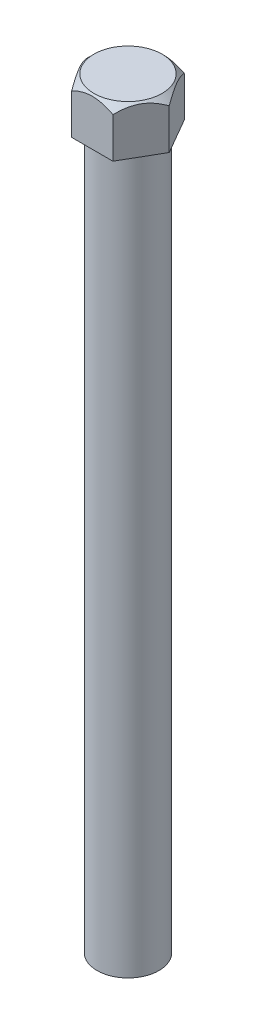
ISO-10303-21;
HEADER;
FILE_DESCRIPTION(('STEP AP214'),'2;1');
FILE_NAME('part.step','',(''),(''),'','','');
FILE_SCHEMA(('AUTOMOTIVE_DESIGN { 1 0 10303 214 1 1 1 1 }'));
ENDSEC;
DATA;
#1=APPLICATION_CONTEXT('core data for automotive mechanical design processes');
#2=APPLICATION_PROTOCOL_DEFINITION('international standard','automotive_design',2000,#1);
#3=PRODUCT_CONTEXT('',#1,'mechanical');
#4=PRODUCT('Part','Part','',(#3));
#5=PRODUCT_RELATED_PRODUCT_CATEGORY('part','',(#4));
#6=PRODUCT_DEFINITION_FORMATION('','',#4);
#7=PRODUCT_DEFINITION_CONTEXT('part definition',#1,'design');
#8=PRODUCT_DEFINITION('design','',#6,#7);
#9=PRODUCT_DEFINITION_SHAPE('','',#8);
#10=(LENGTH_UNIT() NAMED_UNIT(*) SI_UNIT(.MILLI.,.METRE.));
#11=(NAMED_UNIT(*) PLANE_ANGLE_UNIT() SI_UNIT($,.RADIAN.));
#12=(NAMED_UNIT(*) SI_UNIT($,.STERADIAN.) SOLID_ANGLE_UNIT());
#13=UNCERTAINTY_MEASURE_WITH_UNIT(LENGTH_MEASURE(1.E-05),#10,'distance_accuracy_value','');
#14=(GEOMETRIC_REPRESENTATION_CONTEXT(3) GLOBAL_UNCERTAINTY_ASSIGNED_CONTEXT((#13)) GLOBAL_UNIT_ASSIGNED_CONTEXT((#10,
#11,#12)) REPRESENTATION_CONTEXT('',''));
#15=CARTESIAN_POINT('',(0.,0.,0.));
#16=DIRECTION('',(0.,0.,1.));
#17=DIRECTION('',(1.,0.,0.));
#18=AXIS2_PLACEMENT_3D('',#15,#16,#17);
#19=CARTESIAN_POINT('',(0.,3.2,0.));
#20=DIRECTION('',(0.,-1.,0.));
#21=DIRECTION('',(0.,0.,-1.));
#22=AXIS2_PLACEMENT_3D('',#19,#20,#21);
#23=CYLINDRICAL_SURFACE('',#22,0.13);
#24=CARTESIAN_POINT('',(0.,0.,0.));
#25=DIRECTION('',(0.,1.,0.));
#26=DIRECTION('',(0.,0.,1.));
#27=AXIS2_PLACEMENT_3D('',#24,#25,#26);
#28=CIRCLE('',#27,0.13);
#29=CARTESIAN_POINT('',(0.,0.,0.13));
#30=VERTEX_POINT('',#29);
#31=EDGE_CURVE('E45',#30,#30,#28,.T.);
#32=ORIENTED_EDGE('',*,*,#31,.T.);
#33=EDGE_LOOP('',(#32));
#34=FACE_BOUND('',#33,.T.);
#35=CARTESIAN_POINT('',(0.,3.,0.));
#36=DIRECTION('',(0.,1.,0.));
#37=DIRECTION('',(0.,0.,1.));
#38=AXIS2_PLACEMENT_3D('',#35,#36,#37);
#39=CIRCLE('',#38,0.13);
#40=CARTESIAN_POINT('',(0.,3.,0.13));
#41=VERTEX_POINT('',#40);
#42=EDGE_CURVE('E12',#41,#41,#39,.T.);
#43=ORIENTED_EDGE('',*,*,#42,.F.);
#44=EDGE_LOOP('',(#43));
#45=FACE_BOUND('',#44,.T.);
#46=ADVANCED_FACE('F38',(#34,#45),#23,.T.);
#47=CARTESIAN_POINT('',(0.,0.,0.));
#48=DIRECTION('',(0.,1.,0.));
#49=DIRECTION('',(0.,0.,1.));
#50=AXIS2_PLACEMENT_3D('',#47,#48,#49);
#51=PLANE('',#50);
#52=ORIENTED_EDGE('',*,*,#31,.F.);
#53=EDGE_LOOP('',(#52));
#54=FACE_BOUND('',#53,.T.);
#55=ADVANCED_FACE('F217',(#54),#51,.F.);
#56=CARTESIAN_POINT('',(0.0866025403784439,3.,0.15));
#57=DIRECTION('',(0.866025403784439,0.,0.5));
#58=DIRECTION('',(0.5,0.,-0.866025403784439));
#59=AXIS2_PLACEMENT_3D('',#56,#57,#58);
#60=PLANE('',#59);
#61=CARTESIAN_POINT('',(0.086487070324606,3.16988441455308,0.1502));
#62=CARTESIAN_POINT('',(0.0894747314856735,3.1728692939954,0.145025219073231));
#63=CARTESIAN_POINT('',(0.0925061847269978,3.17568184718681,0.139774588038488));
#64=CARTESIAN_POINT('',(0.0986880826967588,3.18083264194967,0.129067226667655));
#65=CARTESIAN_POINT('',(0.101839121414635,3.18316800261969,0.123609467511676));
#66=CARTESIAN_POINT('',(0.11134442329311,3.18913429872302,0.107145801716878));
#67=CARTESIAN_POINT('',(0.11786349315152,3.19184967701747,0.0958544415040206));
#68=CARTESIAN_POINT('',(0.129142807751294,3.19349253805002,0.076318095542659));
#69=CARTESIAN_POINT('',(0.133872001410017,3.19328220421558,0.0681268918469176));
#70=CARTESIAN_POINT('',(0.143233752389886,3.19113971144166,0.0519118635019782));
#71=CARTESIAN_POINT('',(0.147866153897475,3.18920496684668,0.043888308729774));
#72=CARTESIAN_POINT('',(0.156018491692504,3.18452576928618,0.0297680454683198));
#73=CARTESIAN_POINT('',(0.159575311102254,3.18202131757065,0.023607453537286));
#74=CARTESIAN_POINT('',(0.166548991597766,3.17637725141577,0.0115286846033072));
#75=CARTESIAN_POINT('',(0.169966264641955,3.17323969799707,0.00560979406743729));
#76=CARTESIAN_POINT('',(0.173320550810916,3.1698844145544,-0.00020000000032879));
#77=B_SPLINE_CURVE_WITH_KNOTS('',3,(#61,#62,#63,#64,#65,#66,#67,#68,#69,#70,#71,#72,#73,#74,#75,
#76),.UNSPECIFIED.,.F.,.F.,(4,2,2,2,2,2,2,4),(0.,0.0200322815723704,0.0401821439649001,
0.0797202979159774,0.107933680780694,0.136189439305523,0.158782101417156,0.181302367981686),.UNSPECIFIED.);
#78=CARTESIAN_POINT('',(0.0866025403784439,3.17,0.15));
#79=VERTEX_POINT('',#78);
#80=CARTESIAN_POINT('',(0.173205080756888,3.17,0.));
#81=VERTEX_POINT('',#80);
#82=EDGE_CURVE('E52',#79,#81,#77,.T.);
#83=ORIENTED_EDGE('',*,*,#82,.F.);
#84=DIRECTION('',(0.,1.,0.));
#85=VECTOR('',#84,1.);
#86=CARTESIAN_POINT('',(0.0866025403784439,3.,0.15));
#87=LINE('',#86,#85);
#88=CARTESIAN_POINT('',(0.0866025403784439,3.,0.15));
#89=VERTEX_POINT('',#88);
#90=EDGE_CURVE('E59',#89,#79,#87,.T.);
#91=ORIENTED_EDGE('',*,*,#90,.F.);
#92=DIRECTION('',(0.5,0.,-0.866025403784439));
#93=VECTOR('',#92,1.);
#94=CARTESIAN_POINT('',(0.0866025403784439,3.,0.15));
#95=LINE('',#94,#93);
#96=CARTESIAN_POINT('',(0.173205080756888,3.,0.));
#97=VERTEX_POINT('',#96);
#98=EDGE_CURVE('E152',#89,#97,#95,.T.);
#99=ORIENTED_EDGE('',*,*,#98,.T.);
#100=DIRECTION('',(0.,1.,0.));
#101=VECTOR('',#100,1.);
#102=CARTESIAN_POINT('',(0.173205080756888,3.,0.));
#103=LINE('',#102,#101);
#104=EDGE_CURVE('E112',#97,#81,#103,.T.);
#105=ORIENTED_EDGE('',*,*,#104,.T.);
#106=EDGE_LOOP('',(#83,#91,#99,#105));
#107=FACE_BOUND('',#106,.T.);
#108=ADVANCED_FACE('F168',(#107),#60,.T.);
#109=CARTESIAN_POINT('',(-0.0866025403784438,3.,0.15));
#110=DIRECTION('',(0.,0.,1.));
#111=DIRECTION('',(1.,0.,0.));
#112=AXIS2_PLACEMENT_3D('',#109,#110,#111);
#113=PLANE('',#112);
#114=CARTESIAN_POINT('',(-0.262586498690913,3.04079531025542,0.15));
#115=CARTESIAN_POINT('',(-0.254826375964097,3.04753180898604,0.15));
#116=CARTESIAN_POINT('',(-0.247031178307719,3.05422893510501,0.15));
#117=CARTESIAN_POINT('',(-0.231345588074377,3.0675182027981,0.15));
#118=CARTESIAN_POINT('',(-0.223455152298885,3.07411029332349,0.15));
#119=CARTESIAN_POINT('',(-0.199257368061424,3.09397318925053,0.15));
#120=CARTESIAN_POINT('',(-0.18277032448999,3.10702502912681,0.15));
#121=CARTESIAN_POINT('',(-0.148967316027862,3.13211580579962,0.15));
#122=CARTESIAN_POINT('',(-0.131650237829541,3.14415331887066,0.15));
#123=CARTESIAN_POINT('',(-0.104665718305433,3.16043305934934,0.15));
#124=CARTESIAN_POINT('',(-0.095536058861514,3.16554887313006,0.15));
#125=CARTESIAN_POINT('',(-0.0768307253928085,3.17486951186746,0.15));
#126=CARTESIAN_POINT('',(-0.0672559060106042,3.17907600142658,0.15));
#127=CARTESIAN_POINT('',(-0.047365239141126,3.18618311770184,0.15));
#128=CARTESIAN_POINT('',(-0.0370376939426327,3.18905284242856,0.15));
#129=CARTESIAN_POINT('',(-0.0160622657114842,3.1926942585075,0.15));
#130=CARTESIAN_POINT('',(-0.00541707791100121,3.19348025944055,0.15));
#131=CARTESIAN_POINT('',(0.0158055590720296,3.19275009157281,0.15));
#132=CARTESIAN_POINT('',(0.0263828573137492,3.19122989601714,0.15));
#133=CARTESIAN_POINT('',(0.0471394448417878,3.18630245273503,0.15));
#134=CARTESIAN_POINT('',(0.057314980952664,3.18288056134072,0.15));
#135=CARTESIAN_POINT('',(0.0792923162711149,3.17389745377027,0.15));
#136=CARTESIAN_POINT('',(0.0909641323370495,3.1680322739945,0.15));
#137=CARTESIAN_POINT('',(0.113704536639996,3.15521226614443,0.15));
#138=CARTESIAN_POINT('',(0.124771511003989,3.14825469801133,0.15));
#139=CARTESIAN_POINT('',(0.157430248891428,3.12637100732597,0.15));
#140=CARTESIAN_POINT('',(0.178371211639007,3.11048964568697,0.15));
#141=CARTESIAN_POINT('',(0.209758792369402,3.08540645403929,0.15));
#142=CARTESIAN_POINT('',(0.220516380024444,3.0765694094161,0.15));
#143=CARTESIAN_POINT('',(0.241730110308999,3.05877647966747,0.15));
#144=CARTESIAN_POINT('',(0.25218827531801,3.04982301149958,0.15));
#145=CARTESIAN_POINT('',(0.262586498690927,3.04079531025543,0.15));
#146=B_SPLINE_CURVE_WITH_KNOTS('',3,(#114,#115,#116,#117,#118,#119,#120,#121,#122,#123,#124,
#125,#126,#127,#128,#129,#130,#131,#132,#133,#134,#135,#136,#137,#138,#139,#140,#141,#142,#143,
#144,#145),.UNSPECIFIED.,.F.,.F.,(4,2,2,2,2,2,2,2,2,2,2,2,2,2,2,4),(0.,0.0308295106196295,
0.0616735738810822,0.124747488513428,0.187908509085987,0.219272585467536,0.250578751447973,
0.282576530373672,0.314353994406208,0.346187007659216,0.378268611399949,0.417354566871306,
0.456540176553572,0.535274804547155,0.577042635629357,0.61834564938272),.UNSPECIFIED.);
#147=CARTESIAN_POINT('',(-0.0866025403784437,3.17,0.15));
#148=VERTEX_POINT('',#147);
#149=EDGE_CURVE('E161',#148,#79,#146,.T.);
#150=ORIENTED_EDGE('',*,*,#149,.F.);
#151=DIRECTION('',(0.,1.,0.));
#152=VECTOR('',#151,1.);
#153=CARTESIAN_POINT('',(-0.0866025403784438,3.,0.15));
#154=LINE('',#153,#152);
#155=CARTESIAN_POINT('',(-0.0866025403784438,3.,0.15));
#156=VERTEX_POINT('',#155);
#157=EDGE_CURVE('E122',#156,#148,#154,.T.);
#158=ORIENTED_EDGE('',*,*,#157,.F.);
#159=DIRECTION('',(1.,0.,0.));
#160=VECTOR('',#159,1.);
#161=CARTESIAN_POINT('',(-0.0866025403784438,3.,0.15));
#162=LINE('',#161,#160);
#163=EDGE_CURVE('E116',#156,#89,#162,.T.);
#164=ORIENTED_EDGE('',*,*,#163,.T.);
#165=ORIENTED_EDGE('',*,*,#90,.T.);
#166=EDGE_LOOP('',(#150,#158,#164,#165));
#167=FACE_BOUND('',#166,.T.);
#168=ADVANCED_FACE('F204',(#167),#113,.T.);
#169=CARTESIAN_POINT('',(-0.173205080756888,3.,0.));
#170=DIRECTION('',(-0.866025403784438,0.,0.5));
#171=DIRECTION('',(0.5,0.,0.866025403784439));
#172=AXIS2_PLACEMENT_3D('',#169,#170,#171);
#173=PLANE('',#172);
#174=CARTESIAN_POINT('',(-0.173320550810726,3.16988441455308,-0.000200000000000038));
#175=CARTESIAN_POINT('',(-0.170332889649658,3.1728692939954,0.0049747809267692));
#176=CARTESIAN_POINT('',(-0.167301436408334,3.17568184718681,0.0102254119615123));
#177=CARTESIAN_POINT('',(-0.161119538438573,3.18083264194967,0.0209327733323452));
#178=CARTESIAN_POINT('',(-0.157968499720696,3.18316800261969,0.0263905324883241));
#179=CARTESIAN_POINT('',(-0.148463197842221,3.18913429872302,0.0428541982831226));
#180=CARTESIAN_POINT('',(-0.141944127983811,3.19184967701747,0.0541455584959796));
#181=CARTESIAN_POINT('',(-0.130664813384037,3.19349253805002,0.0736819044573411));
#182=CARTESIAN_POINT('',(-0.125935619725314,3.19328220421558,0.0818731081530826));
#183=CARTESIAN_POINT('',(-0.116573868745446,3.19113971144166,0.0980881364980219));
#184=CARTESIAN_POINT('',(-0.111941467237856,3.18920496684668,0.106111691270226));
#185=CARTESIAN_POINT('',(-0.103789129442827,3.18452576928618,0.12023195453168));
#186=CARTESIAN_POINT('',(-0.100232310033077,3.18202131757065,0.126392546462714));
#187=CARTESIAN_POINT('',(-0.0932586295375655,3.17637725141577,0.138471315396693));
#188=CARTESIAN_POINT('',(-0.0898413564933771,3.17323969799707,0.144390205932563));
#189=CARTESIAN_POINT('',(-0.086487070324416,3.1698844145544,0.150200000000329));
#190=B_SPLINE_CURVE_WITH_KNOTS('',3,(#174,#175,#176,#177,#178,#179,#180,#181,#182,#183,#184,
#185,#186,#187,#188,#189),.UNSPECIFIED.,.F.,.F.,(4,2,2,2,2,2,2,4),(0.,0.0200322815723705,
0.0401821439649006,0.0797202979159777,0.107933680780694,0.136189439305524,0.158782101417157,
0.181302367981686),.UNSPECIFIED.);
#191=CARTESIAN_POINT('',(-0.173205080756888,3.17,0.));
#192=VERTEX_POINT('',#191);
#193=EDGE_CURVE('E144',#192,#148,#190,.T.);
#194=ORIENTED_EDGE('',*,*,#193,.F.);
#195=DIRECTION('',(0.,1.,0.));
#196=VECTOR('',#195,1.);
#197=CARTESIAN_POINT('',(-0.173205080756888,3.,0.));
#198=LINE('',#197,#196);
#199=CARTESIAN_POINT('',(-0.173205080756888,3.,0.));
#200=VERTEX_POINT('',#199);
#201=EDGE_CURVE('E114',#200,#192,#198,.T.);
#202=ORIENTED_EDGE('',*,*,#201,.F.);
#203=DIRECTION('',(0.5,0.,0.866025403784438));
#204=VECTOR('',#203,1.);
#205=CARTESIAN_POINT('',(-0.173205080756888,3.,0.));
#206=LINE('',#205,#204);
#207=EDGE_CURVE('E142',#200,#156,#206,.T.);
#208=ORIENTED_EDGE('',*,*,#207,.T.);
#209=ORIENTED_EDGE('',*,*,#157,.T.);
#210=EDGE_LOOP('',(#194,#202,#208,#209));
#211=FACE_BOUND('',#210,.T.);
#212=ADVANCED_FACE('F141',(#211),#173,.T.);
#213=CARTESIAN_POINT('',(-0.0866025403784439,3.,-0.15));
#214=DIRECTION('',(-0.866025403784439,0.,-0.5));
#215=DIRECTION('',(-0.5,0.,0.866025403784439));
#216=AXIS2_PLACEMENT_3D('',#213,#214,#215);
#217=PLANE('',#216);
#218=CARTESIAN_POINT('',(-0.0864870703246059,3.16988441455308,-0.1502));
#219=CARTESIAN_POINT('',(-0.0894747314856735,3.1728692939954,-0.145025219073231));
#220=CARTESIAN_POINT('',(-0.0925061847269978,3.17568184718681,-0.139774588038488));
#221=CARTESIAN_POINT('',(-0.0986880826967587,3.18083264194967,-0.129067226667655));
#222=CARTESIAN_POINT('',(-0.101839121414635,3.18316800261969,-0.123609467511676));
#223=CARTESIAN_POINT('',(-0.11134442329311,3.18913429872302,-0.107145801716878));
#224=CARTESIAN_POINT('',(-0.11786349315152,3.19184967701747,-0.0958544415040205));
#225=CARTESIAN_POINT('',(-0.129142807751294,3.19349253805002,-0.0763180955426589));
#226=CARTESIAN_POINT('',(-0.133872001410017,3.19328220421558,-0.0681268918469174));
#227=CARTESIAN_POINT('',(-0.143233752389886,3.19113971144166,-0.051911863501978));
#228=CARTESIAN_POINT('',(-0.147866153897475,3.18920496684668,-0.0438883087297738));
#229=CARTESIAN_POINT('',(-0.156018491692504,3.18452576928618,-0.0297680454683197));
#230=CARTESIAN_POINT('',(-0.159575311102254,3.18202131757065,-0.0236074535372859));
#231=CARTESIAN_POINT('',(-0.166548991597766,3.17637725141577,-0.0115286846033072));
#232=CARTESIAN_POINT('',(-0.169966264641954,3.17323969799707,-0.00560979406743723));
#233=CARTESIAN_POINT('',(-0.173320550810916,3.1698844145544,0.000200000000328849));
#234=B_SPLINE_CURVE_WITH_KNOTS('',3,(#218,#219,#220,#221,#222,#223,#224,#225,#226,#227,#228,
#229,#230,#231,#232,#233),.UNSPECIFIED.,.F.,.F.,(4,2,2,2,2,2,2,4),(0.,0.0200322815723705,
0.0401821439649002,0.0797202979159776,0.107933680780694,0.136189439305524,0.158782101417156,
0.181302367981686),.UNSPECIFIED.);
#235=CARTESIAN_POINT('',(-0.0866025403784439,3.17,-0.15));
#236=VERTEX_POINT('',#235);
#237=EDGE_CURVE('E106',#236,#192,#234,.T.);
#238=ORIENTED_EDGE('',*,*,#237,.F.);
#239=DIRECTION('',(0.,1.,0.));
#240=VECTOR('',#239,1.);
#241=CARTESIAN_POINT('',(-0.0866025403784439,3.,-0.15));
#242=LINE('',#241,#240);
#243=CARTESIAN_POINT('',(-0.0866025403784439,3.,-0.15));
#244=VERTEX_POINT('',#243);
#245=EDGE_CURVE('E105',#244,#236,#242,.T.);
#246=ORIENTED_EDGE('',*,*,#245,.F.);
#247=DIRECTION('',(-0.5,0.,0.866025403784439));
#248=VECTOR('',#247,1.);
#249=CARTESIAN_POINT('',(-0.0866025403784439,3.,-0.15));
#250=LINE('',#249,#248);
#251=EDGE_CURVE('E136',#244,#200,#250,.T.);
#252=ORIENTED_EDGE('',*,*,#251,.T.);
#253=ORIENTED_EDGE('',*,*,#201,.T.);
#254=EDGE_LOOP('',(#238,#246,#252,#253));
#255=FACE_BOUND('',#254,.T.);
#256=ADVANCED_FACE('F134',(#255),#217,.T.);
#257=CARTESIAN_POINT('',(0.0866025403784437,3.,-0.15));
#258=DIRECTION('',(0.,0.,-1.));
#259=DIRECTION('',(-1.,0.,0.));
#260=AXIS2_PLACEMENT_3D('',#257,#258,#259);
#261=PLANE('',#260);
#262=CARTESIAN_POINT('',(0.262586498690913,3.04079531025542,-0.15));
#263=CARTESIAN_POINT('',(0.254826375964097,3.04753180898604,-0.15));
#264=CARTESIAN_POINT('',(0.247031178307719,3.05422893510501,-0.15));
#265=CARTESIAN_POINT('',(0.231345588074376,3.0675182027981,-0.15));
#266=CARTESIAN_POINT('',(0.223455152298884,3.07411029332349,-0.15));
#267=CARTESIAN_POINT('',(0.199257368061424,3.09397318925053,-0.15));
#268=CARTESIAN_POINT('',(0.18277032448999,3.10702502912681,-0.15));
#269=CARTESIAN_POINT('',(0.148967316027862,3.13211580579962,-0.15));
#270=CARTESIAN_POINT('',(0.131650237829541,3.14415331887066,-0.15));
#271=CARTESIAN_POINT('',(0.104665718305433,3.16043305934934,-0.15));
#272=CARTESIAN_POINT('',(0.0955360588615138,3.16554887313006,-0.15));
#273=CARTESIAN_POINT('',(0.0768307253928083,3.17486951186746,-0.15));
#274=CARTESIAN_POINT('',(0.067255906010604,3.17907600142658,-0.15));
#275=CARTESIAN_POINT('',(0.0473652391411258,3.18618311770184,-0.15));
#276=CARTESIAN_POINT('',(0.0370376939426325,3.18905284242856,-0.15));
#277=CARTESIAN_POINT('',(0.016062265711484,3.1926942585075,-0.15));
#278=CARTESIAN_POINT('',(0.005417077911001,3.19348025944055,-0.15));
#279=CARTESIAN_POINT('',(-0.0158055590720298,3.19275009157281,-0.15));
#280=CARTESIAN_POINT('',(-0.0263828573137494,3.19122989601714,-0.15));
#281=CARTESIAN_POINT('',(-0.047139444841788,3.18630245273503,-0.15));
#282=CARTESIAN_POINT('',(-0.0573149809526641,3.18288056134072,-0.15));
#283=CARTESIAN_POINT('',(-0.0792923162711152,3.17389745377027,-0.15));
#284=CARTESIAN_POINT('',(-0.0909641323370499,3.1680322739945,-0.15));
#285=CARTESIAN_POINT('',(-0.113704536639997,3.15521226614443,-0.15));
#286=CARTESIAN_POINT('',(-0.124771511003989,3.14825469801133,-0.15));
#287=CARTESIAN_POINT('',(-0.157430248891428,3.12637100732597,-0.15));
#288=CARTESIAN_POINT('',(-0.178371211639008,3.11048964568697,-0.15));
#289=CARTESIAN_POINT('',(-0.209758792369403,3.08540645403929,-0.15));
#290=CARTESIAN_POINT('',(-0.220516380024444,3.0765694094161,-0.15));
#291=CARTESIAN_POINT('',(-0.241730110308999,3.05877647966747,-0.15));
#292=CARTESIAN_POINT('',(-0.25218827531801,3.04982301149958,-0.15));
#293=CARTESIAN_POINT('',(-0.262586498690927,3.04079531025543,-0.15));
#294=B_SPLINE_CURVE_WITH_KNOTS('',3,(#262,#263,#264,#265,#266,#267,#268,#269,#270,#271,#272,
#273,#274,#275,#276,#277,#278,#279,#280,#281,#282,#283,#284,#285,#286,#287,#288,#289,#290,#291,
#292,#293),.UNSPECIFIED.,.F.,.F.,(4,2,2,2,2,2,2,2,2,2,2,2,2,2,2,4),(0.,0.0308295106196296,
0.0616735738810822,0.124747488513428,0.187908509085987,0.219272585467536,0.250578751447973,
0.282576530373672,0.314353994406208,0.346187007659216,0.378268611399948,0.417354566871306,
0.456540176553572,0.535274804547156,0.577042635629357,0.61834564938272),.UNSPECIFIED.);
#295=CARTESIAN_POINT('',(0.0866025403784437,3.17,-0.15));
#296=VERTEX_POINT('',#295);
#297=EDGE_CURVE('E92',#296,#236,#294,.T.);
#298=ORIENTED_EDGE('',*,*,#297,.F.);
#299=DIRECTION('',(0.,1.,0.));
#300=VECTOR('',#299,1.);
#301=CARTESIAN_POINT('',(0.0866025403784437,3.,-0.15));
#302=LINE('',#301,#300);
#303=CARTESIAN_POINT('',(0.0866025403784437,3.,-0.15));
#304=VERTEX_POINT('',#303);
#305=EDGE_CURVE('E103',#304,#296,#302,.T.);
#306=ORIENTED_EDGE('',*,*,#305,.F.);
#307=DIRECTION('',(-1.,0.,0.));
#308=VECTOR('',#307,1.);
#309=CARTESIAN_POINT('',(0.0866025403784437,3.,-0.15));
#310=LINE('',#309,#308);
#311=EDGE_CURVE('E147',#304,#244,#310,.T.);
#312=ORIENTED_EDGE('',*,*,#311,.T.);
#313=ORIENTED_EDGE('',*,*,#245,.T.);
#314=EDGE_LOOP('',(#298,#306,#312,#313));
#315=FACE_BOUND('',#314,.T.);
#316=ADVANCED_FACE('F101',(#315),#261,.T.);
#317=CARTESIAN_POINT('',(0.173205080756888,3.,0.));
#318=DIRECTION('',(0.866025403784438,0.,-0.5));
#319=DIRECTION('',(-0.5,0.,-0.866025403784439));
#320=AXIS2_PLACEMENT_3D('',#317,#318,#319);
#321=PLANE('',#320);
#322=CARTESIAN_POINT('',(0.173320550810726,3.16988441455308,0.00020000000000009));
#323=CARTESIAN_POINT('',(0.170332889649658,3.1728692939954,-0.00497478092676922));
#324=CARTESIAN_POINT('',(0.167301436408334,3.17568184718681,-0.0102254119615123));
#325=CARTESIAN_POINT('',(0.161119538438573,3.18083264194967,-0.0209327733323453));
#326=CARTESIAN_POINT('',(0.157968499720696,3.18316800261969,-0.0263905324883241));
#327=CARTESIAN_POINT('',(0.148463197842221,3.18913429872302,-0.0428541982831225));
#328=CARTESIAN_POINT('',(0.141944127983811,3.19184967701747,-0.0541455584959796));
#329=CARTESIAN_POINT('',(0.130664813384037,3.19349253805002,-0.0736819044573411));
#330=CARTESIAN_POINT('',(0.125935619725314,3.19328220421558,-0.0818731081530826));
#331=CARTESIAN_POINT('',(0.116573868745446,3.19113971144166,-0.0980881364980219));
#332=CARTESIAN_POINT('',(0.111941467237856,3.18920496684668,-0.106111691270226));
#333=CARTESIAN_POINT('',(0.103789129442827,3.18452576928618,-0.12023195453168));
#334=CARTESIAN_POINT('',(0.100232310033077,3.18202131757065,-0.126392546462714));
#335=CARTESIAN_POINT('',(0.0932586295375655,3.17637725141577,-0.138471315396693));
#336=CARTESIAN_POINT('',(0.089841356493377,3.17323969799707,-0.144390205932563));
#337=CARTESIAN_POINT('',(0.086487070324416,3.1698844145544,-0.150200000000329));
#338=B_SPLINE_CURVE_WITH_KNOTS('',3,(#322,#323,#324,#325,#326,#327,#328,#329,#330,#331,#332,
#333,#334,#335,#336,#337),.UNSPECIFIED.,.F.,.F.,(4,2,2,2,2,2,2,4),(0.,0.0200322815723707,
0.0401821439649006,0.0797202979159778,0.107933680780694,0.136189439305524,0.158782101417157,
0.181302367981686),.UNSPECIFIED.);
#339=EDGE_CURVE('E88',#81,#296,#338,.T.);
#340=ORIENTED_EDGE('',*,*,#339,.F.);
#341=ORIENTED_EDGE('',*,*,#104,.F.);
#342=DIRECTION('',(-0.5,0.,-0.866025403784438));
#343=VECTOR('',#342,1.);
#344=CARTESIAN_POINT('',(0.173205080756888,3.,0.));
#345=LINE('',#344,#343);
#346=EDGE_CURVE('E111',#97,#304,#345,.T.);
#347=ORIENTED_EDGE('',*,*,#346,.T.);
#348=ORIENTED_EDGE('',*,*,#305,.T.);
#349=EDGE_LOOP('',(#340,#341,#347,#348));
#350=FACE_BOUND('',#349,.T.);
#351=ADVANCED_FACE('F109',(#350),#321,.T.);
#352=CARTESIAN_POINT('',(0.,3.,0.));
#353=DIRECTION('',(0.,1.,0.));
#354=DIRECTION('',(0.,0.,1.));
#355=AXIS2_PLACEMENT_3D('',#352,#353,#354);
#356=PLANE('',#355);
#357=ORIENTED_EDGE('',*,*,#42,.T.);
#358=EDGE_LOOP('',(#357));
#359=FACE_BOUND('',#358,.T.);
#360=ORIENTED_EDGE('',*,*,#98,.F.);
#361=ORIENTED_EDGE('',*,*,#163,.F.);
#362=ORIENTED_EDGE('',*,*,#207,.F.);
#363=ORIENTED_EDGE('',*,*,#251,.F.);
#364=ORIENTED_EDGE('',*,*,#311,.F.);
#365=ORIENTED_EDGE('',*,*,#346,.F.);
#366=EDGE_LOOP('',(#360,#361,#362,#363,#364,#365));
#367=FACE_BOUND('',#366,.T.);
#368=ADVANCED_FACE('F146',(#359,#367),#356,.F.);
#369=CARTESIAN_POINT('',(0.,3.2,0.));
#370=DIRECTION('',(0.,-1.,0.));
#371=DIRECTION('',(0.,0.,-1.));
#372=AXIS2_PLACEMENT_3D('',#369,#370,#371);
#373=CONICAL_SURFACE('',#372,0.143205080756888,0.785398163397447);
#374=ORIENTED_EDGE('',*,*,#82,.T.);
#375=ORIENTED_EDGE('',*,*,#339,.T.);
#376=ORIENTED_EDGE('',*,*,#297,.T.);
#377=ORIENTED_EDGE('',*,*,#237,.T.);
#378=ORIENTED_EDGE('',*,*,#193,.T.);
#379=ORIENTED_EDGE('',*,*,#149,.T.);
#380=EDGE_LOOP('',(#374,#375,#376,#377,#378,#379));
#381=FACE_BOUND('',#380,.T.);
#382=CARTESIAN_POINT('',(0.,3.2,0.));
#383=DIRECTION('',(0.,-1.,0.));
#384=DIRECTION('',(0.,0.,-1.));
#385=AXIS2_PLACEMENT_3D('',#382,#383,#384);
#386=CIRCLE('',#385,0.143205080756888);
#387=CARTESIAN_POINT('',(0.,3.2,-0.143205080756888));
#388=VERTEX_POINT('',#387);
#389=EDGE_CURVE('E97',#388,#388,#386,.T.);
#390=ORIENTED_EDGE('',*,*,#389,.T.);
#391=EDGE_LOOP('',(#390));
#392=FACE_BOUND('',#391,.T.);
#393=ADVANCED_FACE('F90',(#381,#392),#373,.T.);
#394=CARTESIAN_POINT('',(0.,3.2,0.));
#395=DIRECTION('',(0.,1.,0.));
#396=DIRECTION('',(0.,0.,1.));
#397=AXIS2_PLACEMENT_3D('',#394,#395,#396);
#398=PLANE('',#397);
#399=ORIENTED_EDGE('',*,*,#389,.F.);
#400=EDGE_LOOP('',(#399));
#401=FACE_BOUND('',#400,.T.);
#402=ADVANCED_FACE('F175',(#401),#398,.T.);
#403=CLOSED_SHELL('',(#46,#55,#108,#168,#212,#256,#316,#351,#368,#393,#402));
#404=MANIFOLD_SOLID_BREP('B2',#403);
#405=ADVANCED_BREP_SHAPE_REPRESENTATION('',(#18,#404),#14);
#406=SHAPE_DEFINITION_REPRESENTATION(#9,#405);
ENDSEC;
END-ISO-10303-21;
